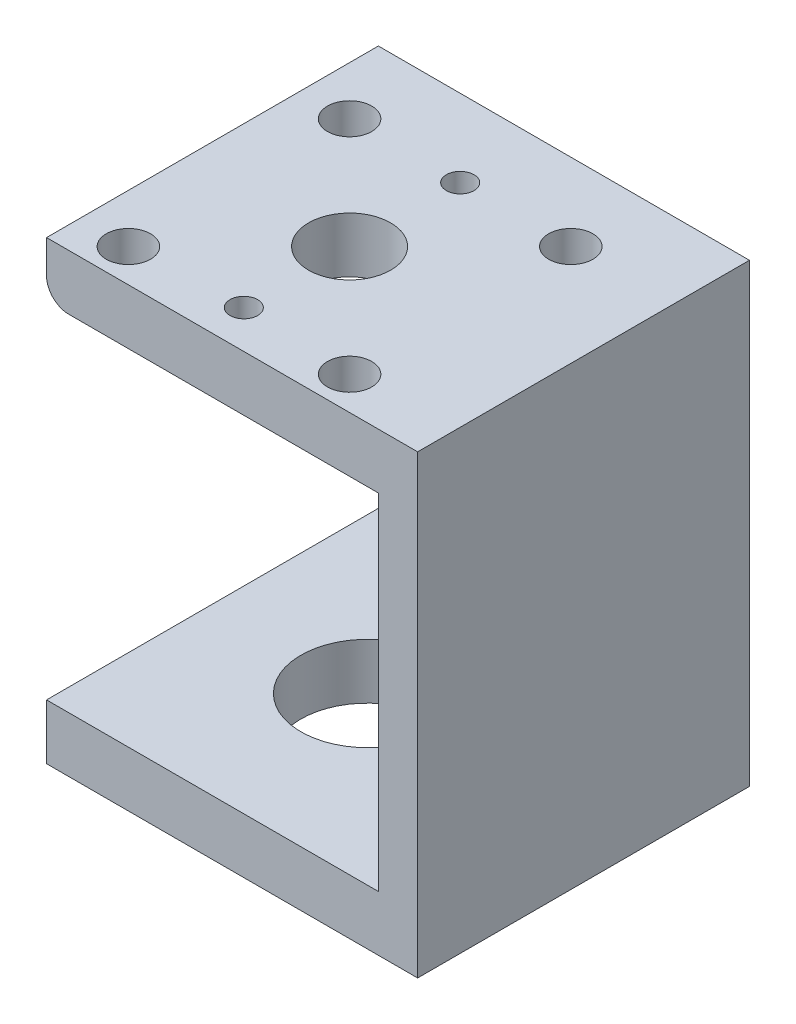
ISO-10303-21;
HEADER;
FILE_DESCRIPTION(('STEP AP214'),'2;1');
FILE_NAME('part.step','',(''),(''),'','','');
FILE_SCHEMA(('AUTOMOTIVE_DESIGN { 1 0 10303 214 1 1 1 1 }'));
ENDSEC;
DATA;
#1=APPLICATION_CONTEXT('core data for automotive mechanical design processes');
#2=APPLICATION_PROTOCOL_DEFINITION('international standard','automotive_design',2000,#1);
#3=PRODUCT_CONTEXT('',#1,'mechanical');
#4=PRODUCT('Part','Part','',(#3));
#5=PRODUCT_RELATED_PRODUCT_CATEGORY('part','',(#4));
#6=PRODUCT_DEFINITION_FORMATION('','',#4);
#7=PRODUCT_DEFINITION_CONTEXT('part definition',#1,'design');
#8=PRODUCT_DEFINITION('design','',#6,#7);
#9=PRODUCT_DEFINITION_SHAPE('','',#8);
#10=(LENGTH_UNIT() NAMED_UNIT(*) SI_UNIT(.MILLI.,.METRE.));
#11=(NAMED_UNIT(*) PLANE_ANGLE_UNIT() SI_UNIT($,.RADIAN.));
#12=(NAMED_UNIT(*) SI_UNIT($,.STERADIAN.) SOLID_ANGLE_UNIT());
#13=UNCERTAINTY_MEASURE_WITH_UNIT(LENGTH_MEASURE(1.E-05),#10,'distance_accuracy_value','');
#14=(GEOMETRIC_REPRESENTATION_CONTEXT(3) GLOBAL_UNCERTAINTY_ASSIGNED_CONTEXT((#13)) GLOBAL_UNIT_ASSIGNED_CONTEXT((#10,
#11,#12)) REPRESENTATION_CONTEXT('',''));
#15=CARTESIAN_POINT('',(0.,0.,0.));
#16=DIRECTION('',(0.,0.,1.));
#17=DIRECTION('',(1.,0.,0.));
#18=AXIS2_PLACEMENT_3D('',#15,#16,#17);
#19=CARTESIAN_POINT('',(-16.7763157894737,41.2,15.));
#20=DIRECTION('',(-1.,0.,0.));
#21=DIRECTION('',(0.,0.,1.));
#22=AXIS2_PLACEMENT_3D('',#19,#20,#21);
#23=PLANE('',#22);
#24=DIRECTION('',(0.,-1.,0.));
#25=VECTOR('',#24,1.);
#26=CARTESIAN_POINT('',(-16.7763157894737,41.2,-15.));
#27=LINE('',#26,#25);
#28=CARTESIAN_POINT('',(-16.7763157894737,41.2,-15.));
#29=VERTEX_POINT('',#28);
#30=CARTESIAN_POINT('',(-16.7763157894737,38.2,-15.));
#31=VERTEX_POINT('',#30);
#32=EDGE_CURVE('E157',#29,#31,#27,.T.);
#33=ORIENTED_EDGE('',*,*,#32,.T.);
#34=DIRECTION('',(0.,0.,1.));
#35=VECTOR('',#34,1.);
#36=CARTESIAN_POINT('',(-16.7763157894737,38.2,15.));
#37=LINE('',#36,#35);
#38=CARTESIAN_POINT('',(-16.7763157894737,38.2,15.));
#39=VERTEX_POINT('',#38);
#40=EDGE_CURVE('E171',#31,#39,#37,.T.);
#41=ORIENTED_EDGE('',*,*,#40,.T.);
#42=DIRECTION('',(0.,-1.,0.));
#43=VECTOR('',#42,1.);
#44=CARTESIAN_POINT('',(-16.7763157894737,41.2,15.));
#45=LINE('',#44,#43);
#46=CARTESIAN_POINT('',(-16.7763157894737,41.2,15.));
#47=VERTEX_POINT('',#46);
#48=EDGE_CURVE('E143',#47,#39,#45,.T.);
#49=ORIENTED_EDGE('',*,*,#48,.F.);
#50=DIRECTION('',(0.,0.,-1.));
#51=VECTOR('',#50,1.);
#52=CARTESIAN_POINT('',(-16.7763157894737,41.2,15.));
#53=LINE('',#52,#51);
#54=EDGE_CURVE('E192',#47,#29,#53,.T.);
#55=ORIENTED_EDGE('',*,*,#54,.T.);
#56=EDGE_LOOP('',(#33,#41,#49,#55));
#57=FACE_BOUND('',#56,.T.);
#58=ADVANCED_FACE('F45',(#57),#23,.T.);
#59=DIRECTION('',(0.,0.,1.));
#60=VECTOR('',#59,1.);
#61=CARTESIAN_POINT('',(-16.7763157894737,5.,-21.2));
#62=LINE('',#61,#60);
#63=CARTESIAN_POINT('',(-16.7763157894737,5.,-15.));
#64=VERTEX_POINT('',#63);
#65=CARTESIAN_POINT('',(-16.7763157894737,5.,15.));
#66=VERTEX_POINT('',#65);
#67=EDGE_CURVE('E116',#64,#66,#62,.T.);
#68=ORIENTED_EDGE('',*,*,#67,.F.);
#69=CARTESIAN_POINT('',(-16.7763157894737,0.,-15.));
#70=VERTEX_POINT('',#69);
#71=EDGE_CURVE('E161',#64,#70,#27,.T.);
#72=ORIENTED_EDGE('',*,*,#71,.T.);
#73=DIRECTION('',(0.,0.,-1.));
#74=VECTOR('',#73,1.);
#75=CARTESIAN_POINT('',(-16.7763157894737,0.,15.));
#76=LINE('',#75,#74);
#77=CARTESIAN_POINT('',(-16.7763157894737,0.,15.));
#78=VERTEX_POINT('',#77);
#79=EDGE_CURVE('E141',#78,#70,#76,.T.);
#80=ORIENTED_EDGE('',*,*,#79,.F.);
#81=EDGE_CURVE('E131',#66,#78,#45,.T.);
#82=ORIENTED_EDGE('',*,*,#81,.F.);
#83=EDGE_LOOP('',(#68,#72,#80,#82));
#84=FACE_BOUND('',#83,.T.);
#85=ADVANCED_FACE('F139',(#84),#23,.T.);
#86=CARTESIAN_POINT('',(-16.7763157894737,41.2,15.));
#87=DIRECTION('',(0.,0.,-1.));
#88=DIRECTION('',(-1.,0.,0.));
#89=AXIS2_PLACEMENT_3D('',#86,#87,#88);
#90=PLANE('',#89);
#91=ORIENTED_EDGE('',*,*,#48,.T.);
#92=CARTESIAN_POINT('',(-14.7763157894737,38.2,15.));
#93=DIRECTION('',(0.,0.,-1.));
#94=DIRECTION('',(-1.,0.,0.));
#95=AXIS2_PLACEMENT_3D('',#92,#93,#94);
#96=CIRCLE('',#95,2.);
#97=CARTESIAN_POINT('',(-14.7763157894737,36.2,15.));
#98=VERTEX_POINT('',#97);
#99=EDGE_CURVE('E68',#39,#98,#96,.F.);
#100=ORIENTED_EDGE('',*,*,#99,.T.);
#101=DIRECTION('',(-1.,0.,0.));
#102=VECTOR('',#101,1.);
#103=CARTESIAN_POINT('',(-16.7763157894737,36.2,15.));
#104=LINE('',#103,#102);
#105=CARTESIAN_POINT('',(13.2236842105263,36.2,15.));
#106=VERTEX_POINT('',#105);
#107=EDGE_CURVE('E128',#106,#98,#104,.T.);
#108=ORIENTED_EDGE('',*,*,#107,.F.);
#109=DIRECTION('',(0.,1.,0.));
#110=VECTOR('',#109,1.);
#111=CARTESIAN_POINT('',(13.2236842105263,36.2,15.));
#112=LINE('',#111,#110);
#113=CARTESIAN_POINT('',(13.2236842105263,5.,15.));
#114=VERTEX_POINT('',#113);
#115=EDGE_CURVE('E134',#114,#106,#112,.T.);
#116=ORIENTED_EDGE('',*,*,#115,.F.);
#117=DIRECTION('',(1.,0.,0.));
#118=VECTOR('',#117,1.);
#119=CARTESIAN_POINT('',(-16.7763157894737,5.,15.));
#120=LINE('',#119,#118);
#121=EDGE_CURVE('E119',#66,#114,#120,.T.);
#122=ORIENTED_EDGE('',*,*,#121,.F.);
#123=ORIENTED_EDGE('',*,*,#81,.T.);
#124=DIRECTION('',(1.,0.,0.));
#125=VECTOR('',#124,1.);
#126=CARTESIAN_POINT('',(-16.7763157894737,0.,15.));
#127=LINE('',#126,#125);
#128=CARTESIAN_POINT('',(16.7763157894737,0.,15.));
#129=VERTEX_POINT('',#128);
#130=EDGE_CURVE('E152',#78,#129,#127,.T.);
#131=ORIENTED_EDGE('',*,*,#130,.T.);
#132=DIRECTION('',(0.,-1.,0.));
#133=VECTOR('',#132,1.);
#134=CARTESIAN_POINT('',(16.7763157894737,41.2,15.));
#135=LINE('',#134,#133);
#136=CARTESIAN_POINT('',(16.7763157894737,41.2,15.));
#137=VERTEX_POINT('',#136);
#138=EDGE_CURVE('E144',#137,#129,#135,.T.);
#139=ORIENTED_EDGE('',*,*,#138,.F.);
#140=DIRECTION('',(1.,0.,0.));
#141=VECTOR('',#140,1.);
#142=CARTESIAN_POINT('',(-16.7763157894737,41.2,15.));
#143=LINE('',#142,#141);
#144=EDGE_CURVE('E184',#47,#137,#143,.T.);
#145=ORIENTED_EDGE('',*,*,#144,.F.);
#146=EDGE_LOOP('',(#91,#100,#108,#116,#122,#123,#131,#139,#145));
#147=FACE_BOUND('',#146,.T.);
#148=ADVANCED_FACE('F130',(#147),#90,.F.);
#149=CARTESIAN_POINT('',(16.7763157894737,41.2,15.));
#150=DIRECTION('',(-1.,0.,0.));
#151=DIRECTION('',(0.,0.,1.));
#152=AXIS2_PLACEMENT_3D('',#149,#150,#151);
#153=PLANE('',#152);
#154=DIRECTION('',(0.,0.,-1.));
#155=VECTOR('',#154,1.);
#156=CARTESIAN_POINT('',(16.7763157894737,0.,15.));
#157=LINE('',#156,#155);
#158=CARTESIAN_POINT('',(16.7763157894737,0.,-15.));
#159=VERTEX_POINT('',#158);
#160=EDGE_CURVE('E201',#129,#159,#157,.T.);
#161=ORIENTED_EDGE('',*,*,#160,.T.);
#162=DIRECTION('',(0.,-1.,0.));
#163=VECTOR('',#162,1.);
#164=CARTESIAN_POINT('',(16.7763157894737,41.2,-15.));
#165=LINE('',#164,#163);
#166=CARTESIAN_POINT('',(16.7763157894737,41.2,-15.));
#167=VERTEX_POINT('',#166);
#168=EDGE_CURVE('E149',#167,#159,#165,.T.);
#169=ORIENTED_EDGE('',*,*,#168,.F.);
#170=DIRECTION('',(0.,0.,-1.));
#171=VECTOR('',#170,1.);
#172=CARTESIAN_POINT('',(16.7763157894737,41.2,15.));
#173=LINE('',#172,#171);
#174=EDGE_CURVE('E189',#137,#167,#173,.T.);
#175=ORIENTED_EDGE('',*,*,#174,.F.);
#176=ORIENTED_EDGE('',*,*,#138,.T.);
#177=EDGE_LOOP('',(#161,#169,#175,#176));
#178=FACE_BOUND('',#177,.T.);
#179=ADVANCED_FACE('F217',(#178),#153,.F.);
#180=CARTESIAN_POINT('',(-16.7763157894737,41.2,-15.));
#181=DIRECTION('',(0.,0.,-1.));
#182=DIRECTION('',(-1.,0.,0.));
#183=AXIS2_PLACEMENT_3D('',#180,#181,#182);
#184=PLANE('',#183);
#185=DIRECTION('',(1.,0.,0.));
#186=VECTOR('',#185,1.);
#187=CARTESIAN_POINT('',(-16.7763157894737,36.2,-15.));
#188=LINE('',#187,#186);
#189=CARTESIAN_POINT('',(-14.7763157894737,36.2,-15.));
#190=VERTEX_POINT('',#189);
#191=CARTESIAN_POINT('',(13.2236842105263,36.2,-15.));
#192=VERTEX_POINT('',#191);
#193=EDGE_CURVE('E168',#190,#192,#188,.T.);
#194=ORIENTED_EDGE('',*,*,#193,.F.);
#195=CARTESIAN_POINT('',(-14.7763157894737,38.2,-15.));
#196=DIRECTION('',(0.,0.,-1.));
#197=DIRECTION('',(-1.,0.,0.));
#198=AXIS2_PLACEMENT_3D('',#195,#196,#197);
#199=CIRCLE('',#198,2.);
#200=EDGE_CURVE('E11',#190,#31,#199,.T.);
#201=ORIENTED_EDGE('',*,*,#200,.T.);
#202=ORIENTED_EDGE('',*,*,#32,.F.);
#203=DIRECTION('',(1.,0.,0.));
#204=VECTOR('',#203,1.);
#205=CARTESIAN_POINT('',(-16.7763157894737,41.2,-15.));
#206=LINE('',#205,#204);
#207=EDGE_CURVE('E195',#29,#167,#206,.T.);
#208=ORIENTED_EDGE('',*,*,#207,.T.);
#209=ORIENTED_EDGE('',*,*,#168,.T.);
#210=DIRECTION('',(1.,0.,0.));
#211=VECTOR('',#210,1.);
#212=CARTESIAN_POINT('',(-16.7763157894737,0.,-15.));
#213=LINE('',#212,#211);
#214=EDGE_CURVE('E208',#70,#159,#213,.T.);
#215=ORIENTED_EDGE('',*,*,#214,.F.);
#216=ORIENTED_EDGE('',*,*,#71,.F.);
#217=DIRECTION('',(-1.,0.,0.));
#218=VECTOR('',#217,1.);
#219=CARTESIAN_POINT('',(-16.7763157894737,5.00000000000001,-15.));
#220=LINE('',#219,#218);
#221=CARTESIAN_POINT('',(13.2236842105263,5.00000000000001,-15.));
#222=VERTEX_POINT('',#221);
#223=EDGE_CURVE('E122',#222,#64,#220,.T.);
#224=ORIENTED_EDGE('',*,*,#223,.F.);
#225=DIRECTION('',(0.,-1.,0.));
#226=VECTOR('',#225,1.);
#227=CARTESIAN_POINT('',(13.2236842105263,41.2,-15.));
#228=LINE('',#227,#226);
#229=EDGE_CURVE('E164',#192,#222,#228,.T.);
#230=ORIENTED_EDGE('',*,*,#229,.F.);
#231=EDGE_LOOP('',(#194,#201,#202,#208,#209,#215,#216,#224,#230));
#232=FACE_BOUND('',#231,.T.);
#233=ADVANCED_FACE('F222',(#232),#184,.T.);
#234=CARTESIAN_POINT('',(0.,41.2,0.));
#235=DIRECTION('',(0.,-1.,0.));
#236=DIRECTION('',(0.,0.,-1.));
#237=AXIS2_PLACEMENT_3D('',#234,#235,#236);
#238=PLANE('',#237);
#239=CARTESIAN_POINT('',(-2.37631578947369,41.2,11.5633308364543));
#240=DIRECTION('',(0.,1.,0.));
#241=DIRECTION('',(0.,0.,1.));
#242=AXIS2_PLACEMENT_3D('',#239,#240,#241);
#243=CIRCLE('',#242,1.25);
#244=CARTESIAN_POINT('',(-2.37631578947369,41.2,12.8133308364543));
#245=VERTEX_POINT('',#244);
#246=EDGE_CURVE('E318',#245,#245,#243,.T.);
#247=ORIENTED_EDGE('',*,*,#246,.F.);
#248=EDGE_LOOP('',(#247));
#249=FACE_BOUND('',#248,.T.);
#250=CARTESIAN_POINT('',(7.62368421052631,41.2,12.));
#251=DIRECTION('',(0.,1.,0.));
#252=DIRECTION('',(0.,0.,1.));
#253=AXIS2_PLACEMENT_3D('',#250,#251,#252);
#254=CIRCLE('',#253,2.);
#255=CARTESIAN_POINT('',(7.62368421052631,41.2,14.));
#256=VERTEX_POINT('',#255);
#257=EDGE_CURVE('E327',#256,#256,#254,.T.);
#258=ORIENTED_EDGE('',*,*,#257,.F.);
#259=EDGE_LOOP('',(#258));
#260=FACE_BOUND('',#259,.T.);
#261=CARTESIAN_POINT('',(-2.37631578947369,41.2,2.));
#262=DIRECTION('',(0.,1.,0.));
#263=DIRECTION('',(0.,0.,1.));
#264=AXIS2_PLACEMENT_3D('',#261,#262,#263);
#265=CIRCLE('',#264,3.71);
#266=CARTESIAN_POINT('',(-2.37631578947369,41.2,5.71));
#267=VERTEX_POINT('',#266);
#268=EDGE_CURVE('E335',#267,#267,#265,.T.);
#269=ORIENTED_EDGE('',*,*,#268,.F.);
#270=EDGE_LOOP('',(#269));
#271=FACE_BOUND('',#270,.T.);
#272=CARTESIAN_POINT('',(7.62368421052631,41.2,-8.));
#273=DIRECTION('',(0.,1.,0.));
#274=DIRECTION('',(0.,0.,1.));
#275=AXIS2_PLACEMENT_3D('',#272,#273,#274);
#276=CIRCLE('',#275,2.);
#277=CARTESIAN_POINT('',(7.62368421052631,41.2,-6.));
#278=VERTEX_POINT('',#277);
#279=EDGE_CURVE('E302',#278,#278,#276,.T.);
#280=ORIENTED_EDGE('',*,*,#279,.F.);
#281=EDGE_LOOP('',(#280));
#282=FACE_BOUND('',#281,.T.);
#283=CARTESIAN_POINT('',(-2.37631578947369,41.2,-8.));
#284=DIRECTION('',(0.,1.,0.));
#285=DIRECTION('',(0.,0.,1.));
#286=AXIS2_PLACEMENT_3D('',#283,#284,#285);
#287=CIRCLE('',#286,1.25);
#288=CARTESIAN_POINT('',(-2.37631578947369,41.2,-6.75));
#289=VERTEX_POINT('',#288);
#290=EDGE_CURVE('E294',#289,#289,#287,.T.);
#291=ORIENTED_EDGE('',*,*,#290,.F.);
#292=EDGE_LOOP('',(#291));
#293=FACE_BOUND('',#292,.T.);
#294=CARTESIAN_POINT('',(-12.3763157894737,41.2,-8.));
#295=DIRECTION('',(0.,1.,0.));
#296=DIRECTION('',(0.,0.,1.));
#297=AXIS2_PLACEMENT_3D('',#294,#295,#296);
#298=CIRCLE('',#297,2.);
#299=CARTESIAN_POINT('',(-12.3763157894737,41.2,-6.));
#300=VERTEX_POINT('',#299);
#301=EDGE_CURVE('E304',#300,#300,#298,.T.);
#302=ORIENTED_EDGE('',*,*,#301,.F.);
#303=EDGE_LOOP('',(#302));
#304=FACE_BOUND('',#303,.T.);
#305=CARTESIAN_POINT('',(-12.3763157894737,41.2,12.));
#306=DIRECTION('',(0.,1.,0.));
#307=DIRECTION('',(0.,0.,1.));
#308=AXIS2_PLACEMENT_3D('',#305,#306,#307);
#309=CIRCLE('',#308,2.);
#310=CARTESIAN_POINT('',(-12.3763157894737,41.2,14.));
#311=VERTEX_POINT('',#310);
#312=EDGE_CURVE('E322',#311,#311,#309,.T.);
#313=ORIENTED_EDGE('',*,*,#312,.F.);
#314=EDGE_LOOP('',(#313));
#315=FACE_BOUND('',#314,.T.);
#316=ORIENTED_EDGE('',*,*,#54,.F.);
#317=ORIENTED_EDGE('',*,*,#144,.T.);
#318=ORIENTED_EDGE('',*,*,#174,.T.);
#319=ORIENTED_EDGE('',*,*,#207,.F.);
#320=EDGE_LOOP('',(#316,#317,#318,#319));
#321=FACE_BOUND('',#320,.T.);
#322=ADVANCED_FACE('F193',(#249,#260,#271,#282,#293,#304,#315,#321),#238,.F.);
#323=CARTESIAN_POINT('',(0.,0.,0.));
#324=DIRECTION('',(0.,-1.,0.));
#325=DIRECTION('',(0.,0.,-1.));
#326=AXIS2_PLACEMENT_3D('',#323,#324,#325);
#327=PLANE('',#326);
#328=CARTESIAN_POINT('',(-2.77999999947368,0.,0.));
#329=DIRECTION('',(0.,-1.,0.));
#330=DIRECTION('',(0.,0.,-1.));
#331=AXIS2_PLACEMENT_3D('',#328,#329,#330);
#332=CIRCLE('',#331,6.);
#333=CARTESIAN_POINT('',(-2.77999999947368,0.,-6.));
#334=VERTEX_POINT('',#333);
#335=EDGE_CURVE('E307',#334,#334,#332,.T.);
#336=ORIENTED_EDGE('',*,*,#335,.F.);
#337=EDGE_LOOP('',(#336));
#338=FACE_BOUND('',#337,.T.);
#339=ORIENTED_EDGE('',*,*,#79,.T.);
#340=ORIENTED_EDGE('',*,*,#214,.T.);
#341=ORIENTED_EDGE('',*,*,#160,.F.);
#342=ORIENTED_EDGE('',*,*,#130,.F.);
#343=EDGE_LOOP('',(#339,#340,#341,#342));
#344=FACE_BOUND('',#343,.T.);
#345=ADVANCED_FACE('F220',(#338,#344),#327,.T.);
#346=CARTESIAN_POINT('',(-16.7763157894737,36.2,-21.2));
#347=DIRECTION('',(0.,1.,0.));
#348=DIRECTION('',(0.,0.,1.));
#349=AXIS2_PLACEMENT_3D('',#346,#347,#348);
#350=PLANE('',#349);
#351=CARTESIAN_POINT('',(-2.37631578947369,36.2,11.5633308364543));
#352=DIRECTION('',(0.,1.,0.));
#353=DIRECTION('',(0.,0.,1.));
#354=AXIS2_PLACEMENT_3D('',#351,#352,#353);
#355=CIRCLE('',#354,1.25);
#356=CARTESIAN_POINT('',(-2.37631578947369,36.2,12.8133308364543));
#357=VERTEX_POINT('',#356);
#358=EDGE_CURVE('E323',#357,#357,#355,.T.);
#359=ORIENTED_EDGE('',*,*,#358,.T.);
#360=EDGE_LOOP('',(#359));
#361=FACE_BOUND('',#360,.T.);
#362=CARTESIAN_POINT('',(7.62368421052631,36.2,12.));
#363=DIRECTION('',(0.,1.,0.));
#364=DIRECTION('',(0.,0.,1.));
#365=AXIS2_PLACEMENT_3D('',#362,#363,#364);
#366=CIRCLE('',#365,2.);
#367=CARTESIAN_POINT('',(7.62368421052631,36.2,14.));
#368=VERTEX_POINT('',#367);
#369=EDGE_CURVE('E331',#368,#368,#366,.T.);
#370=ORIENTED_EDGE('',*,*,#369,.T.);
#371=EDGE_LOOP('',(#370));
#372=FACE_BOUND('',#371,.T.);
#373=CARTESIAN_POINT('',(-2.37631578947369,36.2,2.));
#374=DIRECTION('',(0.,1.,0.));
#375=DIRECTION('',(0.,0.,1.));
#376=AXIS2_PLACEMENT_3D('',#373,#374,#375);
#377=CIRCLE('',#376,3.71);
#378=CARTESIAN_POINT('',(-2.37631578947369,36.2,5.71));
#379=VERTEX_POINT('',#378);
#380=EDGE_CURVE('E339',#379,#379,#377,.T.);
#381=ORIENTED_EDGE('',*,*,#380,.T.);
#382=EDGE_LOOP('',(#381));
#383=FACE_BOUND('',#382,.T.);
#384=CARTESIAN_POINT('',(7.62368421052631,36.2,-8.));
#385=DIRECTION('',(0.,1.,0.));
#386=DIRECTION('',(0.,0.,1.));
#387=AXIS2_PLACEMENT_3D('',#384,#385,#386);
#388=CIRCLE('',#387,2.);
#389=CARTESIAN_POINT('',(7.62368421052631,36.2,-6.));
#390=VERTEX_POINT('',#389);
#391=EDGE_CURVE('E297',#390,#390,#388,.T.);
#392=ORIENTED_EDGE('',*,*,#391,.T.);
#393=EDGE_LOOP('',(#392));
#394=FACE_BOUND('',#393,.T.);
#395=CARTESIAN_POINT('',(-2.37631578947369,36.2,-8.));
#396=DIRECTION('',(0.,1.,0.));
#397=DIRECTION('',(0.,0.,1.));
#398=AXIS2_PLACEMENT_3D('',#395,#396,#397);
#399=CIRCLE('',#398,1.25);
#400=CARTESIAN_POINT('',(-2.37631578947369,36.2,-6.75));
#401=VERTEX_POINT('',#400);
#402=EDGE_CURVE('E291',#401,#401,#399,.T.);
#403=ORIENTED_EDGE('',*,*,#402,.T.);
#404=EDGE_LOOP('',(#403));
#405=FACE_BOUND('',#404,.T.);
#406=CARTESIAN_POINT('',(-12.3763157894737,36.2,-8.));
#407=DIRECTION('',(0.,1.,0.));
#408=DIRECTION('',(0.,0.,1.));
#409=AXIS2_PLACEMENT_3D('',#406,#407,#408);
#410=CIRCLE('',#409,2.);
#411=CARTESIAN_POINT('',(-12.3763157894737,36.2,-6.));
#412=VERTEX_POINT('',#411);
#413=EDGE_CURVE('E313',#412,#412,#410,.T.);
#414=ORIENTED_EDGE('',*,*,#413,.T.);
#415=EDGE_LOOP('',(#414));
#416=FACE_BOUND('',#415,.T.);
#417=CARTESIAN_POINT('',(-12.3763157894737,36.2,12.));
#418=DIRECTION('',(0.,1.,0.));
#419=DIRECTION('',(0.,0.,1.));
#420=AXIS2_PLACEMENT_3D('',#417,#418,#419);
#421=CIRCLE('',#420,2.);
#422=CARTESIAN_POINT('',(-12.3763157894737,36.2,14.));
#423=VERTEX_POINT('',#422);
#424=EDGE_CURVE('E136',#423,#423,#421,.T.);
#425=ORIENTED_EDGE('',*,*,#424,.T.);
#426=EDGE_LOOP('',(#425));
#427=FACE_BOUND('',#426,.T.);
#428=ORIENTED_EDGE('',*,*,#107,.T.);
#429=DIRECTION('',(0.,0.,1.));
#430=VECTOR('',#429,1.);
#431=CARTESIAN_POINT('',(-14.7763157894737,36.2,-15.));
#432=LINE('',#431,#430);
#433=EDGE_CURVE('E54',#98,#190,#432,.F.);
#434=ORIENTED_EDGE('',*,*,#433,.T.);
#435=ORIENTED_EDGE('',*,*,#193,.T.);
#436=DIRECTION('',(0.,0.,1.));
#437=VECTOR('',#436,1.);
#438=CARTESIAN_POINT('',(13.2236842105263,36.2,-21.2));
#439=LINE('',#438,#437);
#440=EDGE_CURVE('E209',#192,#106,#439,.T.);
#441=ORIENTED_EDGE('',*,*,#440,.T.);
#442=EDGE_LOOP('',(#428,#434,#435,#441));
#443=FACE_BOUND('',#442,.T.);
#444=ADVANCED_FACE('F245',(#361,#372,#383,#394,#405,#416,#427,#443),#350,.F.);
#445=CARTESIAN_POINT('',(13.2236842105263,36.2,-21.2));
#446=DIRECTION('',(1.,0.,0.));
#447=DIRECTION('',(0.,1.,0.));
#448=AXIS2_PLACEMENT_3D('',#445,#446,#447);
#449=PLANE('',#448);
#450=ORIENTED_EDGE('',*,*,#229,.T.);
#451=DIRECTION('',(0.,0.,1.));
#452=VECTOR('',#451,1.);
#453=CARTESIAN_POINT('',(13.2236842105263,5.,-21.2));
#454=LINE('',#453,#452);
#455=EDGE_CURVE('E127',#222,#114,#454,.T.);
#456=ORIENTED_EDGE('',*,*,#455,.T.);
#457=ORIENTED_EDGE('',*,*,#115,.T.);
#458=ORIENTED_EDGE('',*,*,#440,.F.);
#459=EDGE_LOOP('',(#450,#456,#457,#458));
#460=FACE_BOUND('',#459,.T.);
#461=ADVANCED_FACE('F253',(#460),#449,.F.);
#462=CARTESIAN_POINT('',(-16.7763157894737,5.,-21.2));
#463=DIRECTION('',(0.,-1.,0.));
#464=DIRECTION('',(0.,0.,-1.));
#465=AXIS2_PLACEMENT_3D('',#462,#463,#464);
#466=PLANE('',#465);
#467=CARTESIAN_POINT('',(-2.77999999947368,5.,0.));
#468=DIRECTION('',(0.,-1.,0.));
#469=DIRECTION('',(0.,0.,-1.));
#470=AXIS2_PLACEMENT_3D('',#467,#468,#469);
#471=CIRCLE('',#470,6.);
#472=CARTESIAN_POINT('',(-2.77999999947368,5.,-6.));
#473=VERTEX_POINT('',#472);
#474=EDGE_CURVE('E317',#473,#473,#471,.T.);
#475=ORIENTED_EDGE('',*,*,#474,.T.);
#476=EDGE_LOOP('',(#475));
#477=FACE_BOUND('',#476,.T.);
#478=ORIENTED_EDGE('',*,*,#223,.T.);
#479=ORIENTED_EDGE('',*,*,#67,.T.);
#480=ORIENTED_EDGE('',*,*,#121,.T.);
#481=ORIENTED_EDGE('',*,*,#455,.F.);
#482=EDGE_LOOP('',(#478,#479,#480,#481));
#483=FACE_BOUND('',#482,.T.);
#484=ADVANCED_FACE('F118',(#477,#483),#466,.F.);
#485=CARTESIAN_POINT('',(-12.3763157894737,36.2,12.));
#486=DIRECTION('',(0.,1.,0.));
#487=DIRECTION('',(0.,0.,1.));
#488=AXIS2_PLACEMENT_3D('',#485,#486,#487);
#489=CYLINDRICAL_SURFACE('',#488,2.);
#490=ORIENTED_EDGE('',*,*,#424,.F.);
#491=EDGE_LOOP('',(#490));
#492=FACE_BOUND('',#491,.T.);
#493=ORIENTED_EDGE('',*,*,#312,.T.);
#494=EDGE_LOOP('',(#493));
#495=FACE_BOUND('',#494,.T.);
#496=ADVANCED_FACE('F252',(#492,#495),#489,.F.);
#497=CARTESIAN_POINT('',(-12.3763157894737,36.2,-8.));
#498=DIRECTION('',(0.,1.,0.));
#499=DIRECTION('',(0.,0.,1.));
#500=AXIS2_PLACEMENT_3D('',#497,#498,#499);
#501=CYLINDRICAL_SURFACE('',#500,2.);
#502=ORIENTED_EDGE('',*,*,#413,.F.);
#503=EDGE_LOOP('',(#502));
#504=FACE_BOUND('',#503,.T.);
#505=ORIENTED_EDGE('',*,*,#301,.T.);
#506=EDGE_LOOP('',(#505));
#507=FACE_BOUND('',#506,.T.);
#508=ADVANCED_FACE('F263',(#504,#507),#501,.F.);
#509=CARTESIAN_POINT('',(-2.37631578947369,36.2,-8.));
#510=DIRECTION('',(0.,1.,0.));
#511=DIRECTION('',(0.,0.,1.));
#512=AXIS2_PLACEMENT_3D('',#509,#510,#511);
#513=CYLINDRICAL_SURFACE('',#512,1.25);
#514=ORIENTED_EDGE('',*,*,#402,.F.);
#515=EDGE_LOOP('',(#514));
#516=FACE_BOUND('',#515,.T.);
#517=ORIENTED_EDGE('',*,*,#290,.T.);
#518=EDGE_LOOP('',(#517));
#519=FACE_BOUND('',#518,.T.);
#520=ADVANCED_FACE('F269',(#516,#519),#513,.F.);
#521=CARTESIAN_POINT('',(7.62368421052631,36.2,-8.));
#522=DIRECTION('',(0.,1.,0.));
#523=DIRECTION('',(0.,0.,1.));
#524=AXIS2_PLACEMENT_3D('',#521,#522,#523);
#525=CYLINDRICAL_SURFACE('',#524,2.);
#526=ORIENTED_EDGE('',*,*,#391,.F.);
#527=EDGE_LOOP('',(#526));
#528=FACE_BOUND('',#527,.T.);
#529=ORIENTED_EDGE('',*,*,#279,.T.);
#530=EDGE_LOOP('',(#529));
#531=FACE_BOUND('',#530,.T.);
#532=ADVANCED_FACE('F265',(#528,#531),#525,.F.);
#533=CARTESIAN_POINT('',(-2.37631578947369,36.2,2.));
#534=DIRECTION('',(0.,1.,0.));
#535=DIRECTION('',(0.,0.,1.));
#536=AXIS2_PLACEMENT_3D('',#533,#534,#535);
#537=CYLINDRICAL_SURFACE('',#536,3.71);
#538=ORIENTED_EDGE('',*,*,#380,.F.);
#539=EDGE_LOOP('',(#538));
#540=FACE_BOUND('',#539,.T.);
#541=ORIENTED_EDGE('',*,*,#268,.T.);
#542=EDGE_LOOP('',(#541));
#543=FACE_BOUND('',#542,.T.);
#544=ADVANCED_FACE('F268',(#540,#543),#537,.F.);
#545=CARTESIAN_POINT('',(7.62368421052631,36.2,12.));
#546=DIRECTION('',(0.,1.,0.));
#547=DIRECTION('',(0.,0.,1.));
#548=AXIS2_PLACEMENT_3D('',#545,#546,#547);
#549=CYLINDRICAL_SURFACE('',#548,2.);
#550=ORIENTED_EDGE('',*,*,#369,.F.);
#551=EDGE_LOOP('',(#550));
#552=FACE_BOUND('',#551,.T.);
#553=ORIENTED_EDGE('',*,*,#257,.T.);
#554=EDGE_LOOP('',(#553));
#555=FACE_BOUND('',#554,.T.);
#556=ADVANCED_FACE('F273',(#552,#555),#549,.F.);
#557=CARTESIAN_POINT('',(-2.37631578947369,36.2,11.5633308364543));
#558=DIRECTION('',(0.,1.,0.));
#559=DIRECTION('',(0.,0.,1.));
#560=AXIS2_PLACEMENT_3D('',#557,#558,#559);
#561=CYLINDRICAL_SURFACE('',#560,1.25);
#562=ORIENTED_EDGE('',*,*,#358,.F.);
#563=EDGE_LOOP('',(#562));
#564=FACE_BOUND('',#563,.T.);
#565=ORIENTED_EDGE('',*,*,#246,.T.);
#566=EDGE_LOOP('',(#565));
#567=FACE_BOUND('',#566,.T.);
#568=ADVANCED_FACE('F229',(#564,#567),#561,.F.);
#569=CARTESIAN_POINT('',(-2.77999999947368,5.,0.));
#570=DIRECTION('',(0.,-1.,0.));
#571=DIRECTION('',(0.,0.,-1.));
#572=AXIS2_PLACEMENT_3D('',#569,#570,#571);
#573=CYLINDRICAL_SURFACE('',#572,6.);
#574=ORIENTED_EDGE('',*,*,#474,.F.);
#575=EDGE_LOOP('',(#574));
#576=FACE_BOUND('',#575,.T.);
#577=ORIENTED_EDGE('',*,*,#335,.T.);
#578=EDGE_LOOP('',(#577));
#579=FACE_BOUND('',#578,.T.);
#580=ADVANCED_FACE('F225',(#576,#579),#573,.F.);
#581=CARTESIAN_POINT('',(-14.7763157894737,38.2,15.));
#582=DIRECTION('',(0.,0.,-1.));
#583=DIRECTION('',(-1.,0.,0.));
#584=AXIS2_PLACEMENT_3D('',#581,#582,#583);
#585=CYLINDRICAL_SURFACE('',#584,2.);
#586=ORIENTED_EDGE('',*,*,#200,.F.);
#587=ORIENTED_EDGE('',*,*,#433,.F.);
#588=ORIENTED_EDGE('',*,*,#99,.F.);
#589=ORIENTED_EDGE('',*,*,#40,.F.);
#590=EDGE_LOOP('',(#586,#587,#588,#589));
#591=FACE_BOUND('',#590,.T.);
#592=ADVANCED_FACE('F47',(#591),#585,.T.);
#593=CLOSED_SHELL('',(#58,#85,#148,#179,#233,#322,#345,#444,#461,#484,#496,#508,#520,#532,#544,
#556,#568,#580,#592));
#594=MANIFOLD_SOLID_BREP('B2',#593);
#595=ADVANCED_BREP_SHAPE_REPRESENTATION('',(#18,#594),#14);
#596=SHAPE_DEFINITION_REPRESENTATION(#9,#595);
ENDSEC;
END-ISO-10303-21;
